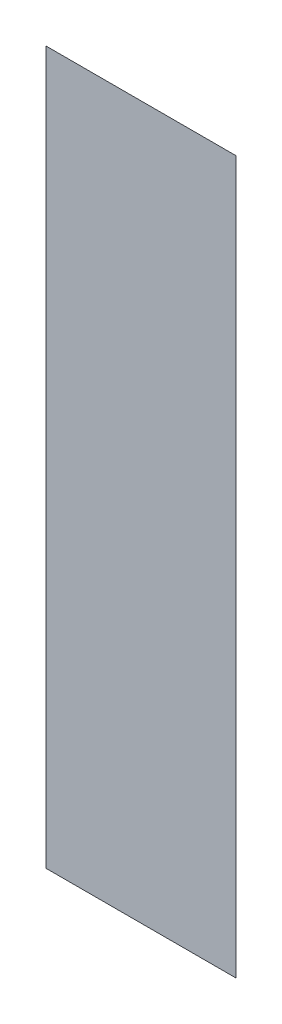
ISO-10303-21;
HEADER;
FILE_DESCRIPTION(('STEP AP214'),'2;1');
FILE_NAME('part.step','',(''),(''),'','','');
FILE_SCHEMA(('AUTOMOTIVE_DESIGN { 1 0 10303 214 1 1 1 1 }'));
ENDSEC;
DATA;
#1=APPLICATION_CONTEXT('core data for automotive mechanical design processes');
#2=APPLICATION_PROTOCOL_DEFINITION('international standard','automotive_design',2000,#1);
#3=PRODUCT_CONTEXT('',#1,'mechanical');
#4=PRODUCT('Part','Part','',(#3));
#5=PRODUCT_RELATED_PRODUCT_CATEGORY('part','',(#4));
#6=PRODUCT_DEFINITION_FORMATION('','',#4);
#7=PRODUCT_DEFINITION_CONTEXT('part definition',#1,'design');
#8=PRODUCT_DEFINITION('design','',#6,#7);
#9=PRODUCT_DEFINITION_SHAPE('','',#8);
#10=(LENGTH_UNIT() NAMED_UNIT(*) SI_UNIT(.MILLI.,.METRE.));
#11=(NAMED_UNIT(*) PLANE_ANGLE_UNIT() SI_UNIT($,.RADIAN.));
#12=(NAMED_UNIT(*) SI_UNIT($,.STERADIAN.) SOLID_ANGLE_UNIT());
#13=UNCERTAINTY_MEASURE_WITH_UNIT(LENGTH_MEASURE(1.E-05),#10,'distance_accuracy_value','');
#14=(GEOMETRIC_REPRESENTATION_CONTEXT(3) GLOBAL_UNCERTAINTY_ASSIGNED_CONTEXT((#13)) GLOBAL_UNIT_ASSIGNED_CONTEXT((#10,
#11,#12)) REPRESENTATION_CONTEXT('',''));
#15=CARTESIAN_POINT('',(0.,0.,0.));
#16=DIRECTION('',(0.,0.,1.));
#17=DIRECTION('',(1.,0.,0.));
#18=AXIS2_PLACEMENT_3D('',#15,#16,#17);
#19=CARTESIAN_POINT('',(0.851390104186754,-0.605432380416251,0.0889425196850394));
#20=DIRECTION('',(0.,0.,1.));
#21=DIRECTION('',(0.,-1.,0.));
#22=AXIS2_PLACEMENT_3D('',#19,#20,#21);
#23=PLANE('',#22);
#24=CARTESIAN_POINT('',(0.840807427021399,-0.607322144195778,0.0889425196850394));
#25=DIRECTION('',(1.,0.,0.));
#26=VECTOR('',#25,1.);
#27=LINE('',#24,#26);
#28=CARTESIAN_POINT('',(0.840807427021399,-0.607322144195778,0.0890685039370079));
#29=VERTEX_POINT('',#28);
#30=CARTESIAN_POINT('',(0.85088616717888,-0.607322144195778,0.0890685039370079));
#31=VERTEX_POINT('',#30);
#32=EDGE_CURVE('E50',#29,#31,#27,.T.);
#33=ORIENTED_EDGE('',*,*,#32,.T.);
#34=CARTESIAN_POINT('',(0.85088616717888,-0.607322144195778,0.0889425196850394));
#35=DIRECTION('',(0.,-1.,0.));
#36=VECTOR('',#35,1.);
#37=LINE('',#34,#36);
#38=CARTESIAN_POINT('',(0.85088616717888,-0.64511741978633,0.0890685039370079));
#39=VERTEX_POINT('',#38);
#40=EDGE_CURVE('E28',#31,#39,#37,.T.);
#41=ORIENTED_EDGE('',*,*,#40,.T.);
#42=CARTESIAN_POINT('',(0.85088616717888,-0.64511741978633,0.0889425196850394));
#43=DIRECTION('',(-1.,0.,0.));
#44=VECTOR('',#43,1.);
#45=LINE('',#42,#44);
#46=CARTESIAN_POINT('',(0.840807427021399,-0.64511741978633,0.0890685039370079));
#47=VERTEX_POINT('',#46);
#48=EDGE_CURVE('E11',#39,#47,#45,.T.);
#49=ORIENTED_EDGE('',*,*,#48,.T.);
#50=CARTESIAN_POINT('',(0.840807427021399,-0.64511741978633,0.0889425196850394));
#51=DIRECTION('',(0.,1.,0.));
#52=VECTOR('',#51,1.);
#53=LINE('',#50,#52);
#54=EDGE_CURVE('E41',#47,#29,#53,.T.);
#55=ORIENTED_EDGE('',*,*,#54,.T.);
#56=EDGE_LOOP('',(#33,#41,#49,#55));
#57=FACE_BOUND('',#56,.T.);
#58=ADVANCED_FACE('F17',(#57),#23,.F.);
#59=CARTESIAN_POINT('',(0.851390104186754,-0.605432380416251,0.0891944881889764));
#60=DIRECTION('',(0.,0.,1.));
#61=DIRECTION('',(0.,-1.,0.));
#62=AXIS2_PLACEMENT_3D('',#59,#60,#61);
#63=PLANE('',#62);
#64=ORIENTED_EDGE('',*,*,#40,.F.);
#65=ORIENTED_EDGE('',*,*,#32,.F.);
#66=ORIENTED_EDGE('',*,*,#54,.F.);
#67=ORIENTED_EDGE('',*,*,#48,.F.);
#68=EDGE_LOOP('',(#64,#65,#66,#67));
#69=FACE_BOUND('',#68,.T.);
#70=ADVANCED_FACE('F49',(#69),#63,.T.);
#71=CLOSED_SHELL('',(#58,#70));
#72=MANIFOLD_SOLID_BREP('B1',#71);
#73=ADVANCED_BREP_SHAPE_REPRESENTATION('',(#18,#72),#14);
#74=SHAPE_DEFINITION_REPRESENTATION(#9,#73);
ENDSEC;
END-ISO-10303-21;
